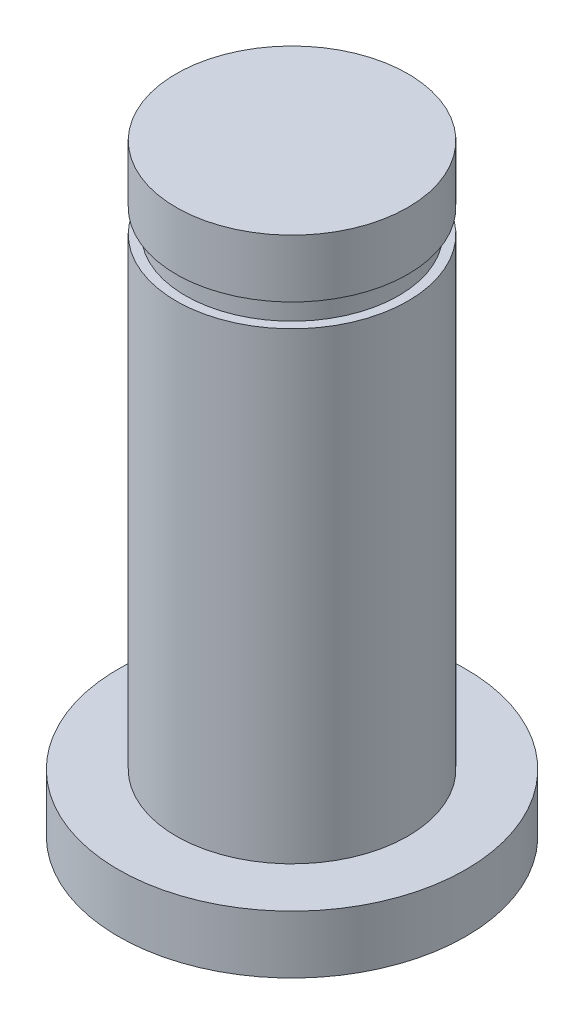
ISO-10303-21;
HEADER;
FILE_DESCRIPTION(('STEP AP214'),'2;1');
FILE_NAME('part.step','',(''),(''),'','','');
FILE_SCHEMA(('AUTOMOTIVE_DESIGN { 1 0 10303 214 1 1 1 1 }'));
ENDSEC;
DATA;
#1=APPLICATION_CONTEXT('core data for automotive mechanical design processes');
#2=APPLICATION_PROTOCOL_DEFINITION('international standard','automotive_design',2000,#1);
#3=PRODUCT_CONTEXT('',#1,'mechanical');
#4=PRODUCT('Part','Part','',(#3));
#5=PRODUCT_RELATED_PRODUCT_CATEGORY('part','',(#4));
#6=PRODUCT_DEFINITION_FORMATION('','',#4);
#7=PRODUCT_DEFINITION_CONTEXT('part definition',#1,'design');
#8=PRODUCT_DEFINITION('design','',#6,#7);
#9=PRODUCT_DEFINITION_SHAPE('','',#8);
#10=(LENGTH_UNIT() NAMED_UNIT(*) SI_UNIT(.MILLI.,.METRE.));
#11=(NAMED_UNIT(*) PLANE_ANGLE_UNIT() SI_UNIT($,.RADIAN.));
#12=(NAMED_UNIT(*) SI_UNIT($,.STERADIAN.) SOLID_ANGLE_UNIT());
#13=UNCERTAINTY_MEASURE_WITH_UNIT(LENGTH_MEASURE(1.E-05),#10,'distance_accuracy_value','');
#14=(GEOMETRIC_REPRESENTATION_CONTEXT(3) GLOBAL_UNCERTAINTY_ASSIGNED_CONTEXT((#13)) GLOBAL_UNIT_ASSIGNED_CONTEXT((#10,
#11,#12)) REPRESENTATION_CONTEXT('',''));
#15=CARTESIAN_POINT('',(0.,0.,0.));
#16=DIRECTION('',(0.,0.,1.));
#17=DIRECTION('',(1.,0.,0.));
#18=AXIS2_PLACEMENT_3D('',#15,#16,#17);
#19=CARTESIAN_POINT('',(0.,0.,0.));
#20=DIRECTION('',(0.,-1.,0.));
#21=DIRECTION('',(1.,0.,0.));
#22=AXIS2_PLACEMENT_3D('',#19,#20,#21);
#23=PLANE('',#22);
#24=CARTESIAN_POINT('',(0.,0.,0.));
#25=DIRECTION('',(0.,-1.,0.));
#26=DIRECTION('',(1.,0.,0.));
#27=AXIS2_PLACEMENT_3D('',#24,#25,#26);
#28=CIRCLE('',#27,3.175);
#29=CARTESIAN_POINT('',(3.175,0.,0.));
#30=VERTEX_POINT('',#29);
#31=EDGE_CURVE('E10',#30,#30,#28,.T.);
#32=ORIENTED_EDGE('',*,*,#31,.F.);
#33=EDGE_LOOP('',(#32));
#34=FACE_BOUND('',#33,.T.);
#35=ADVANCED_FACE('F37',(#34),#23,.F.);
#36=CARTESIAN_POINT('',(0.,-16.51,0.));
#37=DIRECTION('',(0.,-1.,0.));
#38=DIRECTION('',(1.,0.,0.));
#39=AXIS2_PLACEMENT_3D('',#36,#37,#38);
#40=CYLINDRICAL_SURFACE('',#39,3.175);
#41=CARTESIAN_POINT('',(0.,-1.5875,0.));
#42=DIRECTION('',(0.,-1.,0.));
#43=DIRECTION('',(1.,0.,0.));
#44=AXIS2_PLACEMENT_3D('',#41,#42,#43);
#45=CIRCLE('',#44,3.175);
#46=CARTESIAN_POINT('',(3.175,-1.5875,0.));
#47=VERTEX_POINT('',#46);
#48=EDGE_CURVE('E44',#47,#47,#45,.T.);
#49=ORIENTED_EDGE('',*,*,#48,.F.);
#50=EDGE_LOOP('',(#49));
#51=FACE_BOUND('',#50,.T.);
#52=ORIENTED_EDGE('',*,*,#31,.T.);
#53=EDGE_LOOP('',(#52));
#54=FACE_BOUND('',#53,.T.);
#55=ADVANCED_FACE('F111',(#51,#54),#40,.T.);
#56=CARTESIAN_POINT('',(-3.175,-1.5875,0.));
#57=DIRECTION('',(0.,1.,0.));
#58=DIRECTION('',(-1.,0.,0.));
#59=AXIS2_PLACEMENT_3D('',#56,#57,#58);
#60=PLANE('',#59);
#61=CARTESIAN_POINT('',(0.,-1.5875,0.));
#62=DIRECTION('',(0.,-1.,0.));
#63=DIRECTION('',(1.,0.,0.));
#64=AXIS2_PLACEMENT_3D('',#61,#62,#63);
#65=CIRCLE('',#64,2.921);
#66=CARTESIAN_POINT('',(2.921,-1.5875,0.));
#67=VERTEX_POINT('',#66);
#68=EDGE_CURVE('E49',#67,#67,#65,.T.);
#69=ORIENTED_EDGE('',*,*,#68,.F.);
#70=EDGE_LOOP('',(#69));
#71=FACE_BOUND('',#70,.T.);
#72=ORIENTED_EDGE('',*,*,#48,.T.);
#73=EDGE_LOOP('',(#72));
#74=FACE_BOUND('',#73,.T.);
#75=ADVANCED_FACE('F106',(#71,#74),#60,.F.);
#76=CARTESIAN_POINT('',(0.,-16.51,0.));
#77=DIRECTION('',(0.,-1.,0.));
#78=DIRECTION('',(1.,0.,0.));
#79=AXIS2_PLACEMENT_3D('',#76,#77,#78);
#80=CYLINDRICAL_SURFACE('',#79,2.921);
#81=CARTESIAN_POINT('',(0.,-2.2225,0.));
#82=DIRECTION('',(0.,-1.,0.));
#83=DIRECTION('',(1.,0.,0.));
#84=AXIS2_PLACEMENT_3D('',#81,#82,#83);
#85=CIRCLE('',#84,2.921);
#86=CARTESIAN_POINT('',(2.921,-2.2225,0.));
#87=VERTEX_POINT('',#86);
#88=EDGE_CURVE('E54',#87,#87,#85,.T.);
#89=ORIENTED_EDGE('',*,*,#88,.F.);
#90=EDGE_LOOP('',(#89));
#91=FACE_BOUND('',#90,.T.);
#92=ORIENTED_EDGE('',*,*,#68,.T.);
#93=EDGE_LOOP('',(#92));
#94=FACE_BOUND('',#93,.T.);
#95=ADVANCED_FACE('F100',(#91,#94),#80,.T.);
#96=CARTESIAN_POINT('',(-2.921,-2.2225,0.));
#97=DIRECTION('',(0.,-1.,0.));
#98=DIRECTION('',(1.,0.,0.));
#99=AXIS2_PLACEMENT_3D('',#96,#97,#98);
#100=PLANE('',#99);
#101=CARTESIAN_POINT('',(0.,-2.2225,0.));
#102=DIRECTION('',(0.,-1.,0.));
#103=DIRECTION('',(1.,0.,0.));
#104=AXIS2_PLACEMENT_3D('',#101,#102,#103);
#105=CIRCLE('',#104,3.175);
#106=CARTESIAN_POINT('',(3.175,-2.2225,0.));
#107=VERTEX_POINT('',#106);
#108=EDGE_CURVE('E60',#107,#107,#105,.T.);
#109=ORIENTED_EDGE('',*,*,#108,.F.);
#110=EDGE_LOOP('',(#109));
#111=FACE_BOUND('',#110,.T.);
#112=ORIENTED_EDGE('',*,*,#88,.T.);
#113=EDGE_LOOP('',(#112));
#114=FACE_BOUND('',#113,.T.);
#115=ADVANCED_FACE('F94',(#111,#114),#100,.F.);
#116=CARTESIAN_POINT('',(0.,-16.51,0.));
#117=DIRECTION('',(0.,-1.,0.));
#118=DIRECTION('',(1.,0.,0.));
#119=AXIS2_PLACEMENT_3D('',#116,#117,#118);
#120=CYLINDRICAL_SURFACE('',#119,3.175);
#121=CARTESIAN_POINT('',(0.,-14.9225,0.));
#122=DIRECTION('',(0.,-1.,0.));
#123=DIRECTION('',(1.,0.,0.));
#124=AXIS2_PLACEMENT_3D('',#121,#122,#123);
#125=CIRCLE('',#124,3.175);
#126=CARTESIAN_POINT('',(3.175,-14.9225,0.));
#127=VERTEX_POINT('',#126);
#128=EDGE_CURVE('E64',#127,#127,#125,.T.);
#129=ORIENTED_EDGE('',*,*,#128,.F.);
#130=EDGE_LOOP('',(#129));
#131=FACE_BOUND('',#130,.T.);
#132=ORIENTED_EDGE('',*,*,#108,.T.);
#133=EDGE_LOOP('',(#132));
#134=FACE_BOUND('',#133,.T.);
#135=ADVANCED_FACE('F88',(#131,#134),#120,.T.);
#136=CARTESIAN_POINT('',(-4.7625,-14.9225,0.));
#137=DIRECTION('',(0.,-1.,0.));
#138=DIRECTION('',(1.,0.,0.));
#139=AXIS2_PLACEMENT_3D('',#136,#137,#138);
#140=PLANE('',#139);
#141=CARTESIAN_POINT('',(0.,-14.9225,0.));
#142=DIRECTION('',(0.,-1.,0.));
#143=DIRECTION('',(1.,0.,0.));
#144=AXIS2_PLACEMENT_3D('',#141,#142,#143);
#145=CIRCLE('',#144,4.7625);
#146=CARTESIAN_POINT('',(4.7625,-14.9225,0.));
#147=VERTEX_POINT('',#146);
#148=EDGE_CURVE('E68',#147,#147,#145,.T.);
#149=ORIENTED_EDGE('',*,*,#148,.F.);
#150=EDGE_LOOP('',(#149));
#151=FACE_BOUND('',#150,.T.);
#152=ORIENTED_EDGE('',*,*,#128,.T.);
#153=EDGE_LOOP('',(#152));
#154=FACE_BOUND('',#153,.T.);
#155=ADVANCED_FACE('F82',(#151,#154),#140,.F.);
#156=CARTESIAN_POINT('',(0.,-16.51,0.));
#157=DIRECTION('',(0.,-1.,0.));
#158=DIRECTION('',(1.,0.,0.));
#159=AXIS2_PLACEMENT_3D('',#156,#157,#158);
#160=CYLINDRICAL_SURFACE('',#159,4.7625);
#161=CARTESIAN_POINT('',(0.,-16.51,0.));
#162=DIRECTION('',(0.,-1.,0.));
#163=DIRECTION('',(1.,0.,0.));
#164=AXIS2_PLACEMENT_3D('',#161,#162,#163);
#165=CIRCLE('',#164,4.7625);
#166=CARTESIAN_POINT('',(4.7625,-16.51,0.));
#167=VERTEX_POINT('',#166);
#168=EDGE_CURVE('E72',#167,#167,#165,.T.);
#169=ORIENTED_EDGE('',*,*,#168,.F.);
#170=EDGE_LOOP('',(#169));
#171=FACE_BOUND('',#170,.T.);
#172=ORIENTED_EDGE('',*,*,#148,.T.);
#173=EDGE_LOOP('',(#172));
#174=FACE_BOUND('',#173,.T.);
#175=ADVANCED_FACE('F79',(#171,#174),#160,.T.);
#176=CARTESIAN_POINT('',(-4.7625,-16.51,0.));
#177=DIRECTION('',(0.,1.,0.));
#178=DIRECTION('',(-1.,0.,0.));
#179=AXIS2_PLACEMENT_3D('',#176,#177,#178);
#180=PLANE('',#179);
#181=ORIENTED_EDGE('',*,*,#168,.T.);
#182=EDGE_LOOP('',(#181));
#183=FACE_BOUND('',#182,.T.);
#184=ADVANCED_FACE('F77',(#183),#180,.F.);
#185=CLOSED_SHELL('',(#35,#55,#75,#95,#115,#135,#155,#175,#184));
#186=MANIFOLD_SOLID_BREP('B2',#185);
#187=ADVANCED_BREP_SHAPE_REPRESENTATION('',(#18,#186),#14);
#188=SHAPE_DEFINITION_REPRESENTATION(#9,#187);
ENDSEC;
END-ISO-10303-21;
